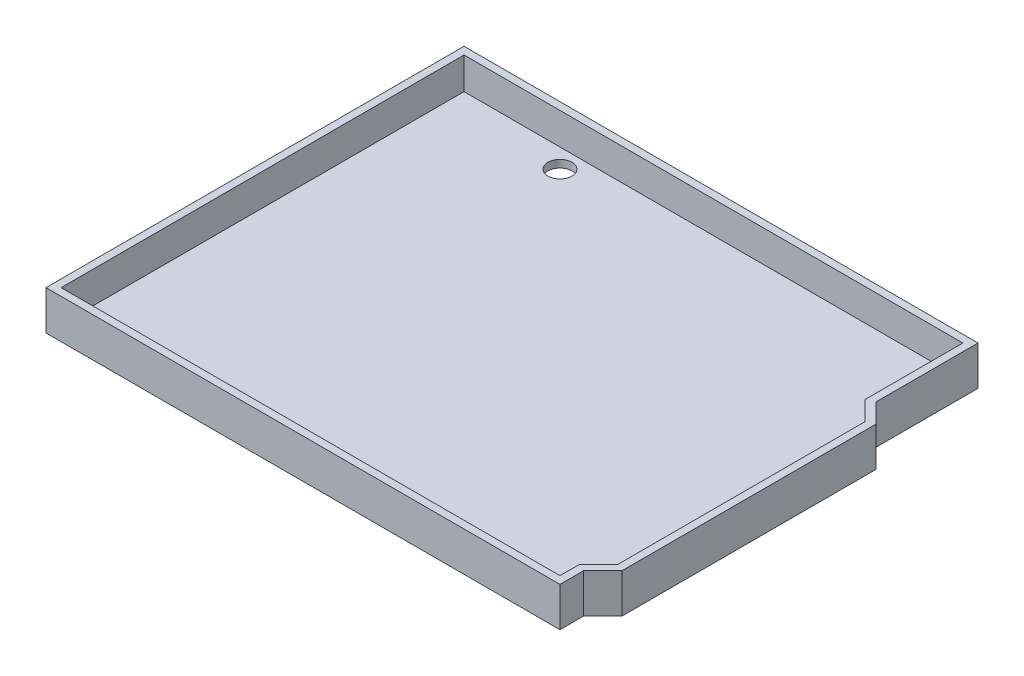
ISO-10303-21;
HEADER;
FILE_DESCRIPTION(('STEP AP214'),'2;1');
FILE_NAME('part.step','',(''),(''),'','','');
FILE_SCHEMA(('AUTOMOTIVE_DESIGN { 1 0 10303 214 1 1 1 1 }'));
ENDSEC;
DATA;
#1=APPLICATION_CONTEXT('core data for automotive mechanical design processes');
#2=APPLICATION_PROTOCOL_DEFINITION('international standard','automotive_design',2000,#1);
#3=PRODUCT_CONTEXT('',#1,'mechanical');
#4=PRODUCT('Part','Part','',(#3));
#5=PRODUCT_RELATED_PRODUCT_CATEGORY('part','',(#4));
#6=PRODUCT_DEFINITION_FORMATION('','',#4);
#7=PRODUCT_DEFINITION_CONTEXT('part definition',#1,'design');
#8=PRODUCT_DEFINITION('design','',#6,#7);
#9=PRODUCT_DEFINITION_SHAPE('','',#8);
#10=(LENGTH_UNIT() NAMED_UNIT(*) SI_UNIT(.MILLI.,.METRE.));
#11=(NAMED_UNIT(*) PLANE_ANGLE_UNIT() SI_UNIT($,.RADIAN.));
#12=(NAMED_UNIT(*) SI_UNIT($,.STERADIAN.) SOLID_ANGLE_UNIT());
#13=UNCERTAINTY_MEASURE_WITH_UNIT(LENGTH_MEASURE(1.E-05),#10,'distance_accuracy_value','');
#14=(GEOMETRIC_REPRESENTATION_CONTEXT(3) GLOBAL_UNCERTAINTY_ASSIGNED_CONTEXT((#13)) GLOBAL_UNIT_ASSIGNED_CONTEXT((#10,
#11,#12)) REPRESENTATION_CONTEXT('',''));
#15=CARTESIAN_POINT('',(0.,0.,0.));
#16=DIRECTION('',(0.,0.,1.));
#17=DIRECTION('',(1.,0.,0.));
#18=AXIS2_PLACEMENT_3D('',#15,#16,#17);
#19=CARTESIAN_POINT('',(33.02,-5.2,19.05));
#20=DIRECTION('',(0.,1.,0.));
#21=DIRECTION('',(0.,0.,1.));
#22=AXIS2_PLACEMENT_3D('',#19,#20,#21);
#23=CYLINDRICAL_SURFACE('',#22,1.59);
#24=CARTESIAN_POINT('',(33.02,-5.2,19.05));
#25=DIRECTION('',(0.,1.,0.));
#26=DIRECTION('',(0.,0.,1.));
#27=AXIS2_PLACEMENT_3D('',#24,#25,#26);
#28=CIRCLE('',#27,1.59);
#29=CARTESIAN_POINT('',(33.02,-5.2,20.64));
#30=VERTEX_POINT('',#29);
#31=EDGE_CURVE('E211',#30,#30,#28,.T.);
#32=ORIENTED_EDGE('',*,*,#31,.F.);
#33=EDGE_LOOP('',(#32));
#34=FACE_BOUND('',#33,.T.);
#35=CARTESIAN_POINT('',(33.02,-4.2,19.05));
#36=DIRECTION('',(0.,1.,0.));
#37=DIRECTION('',(0.,0.,1.));
#38=AXIS2_PLACEMENT_3D('',#35,#36,#37);
#39=CIRCLE('',#38,1.59);
#40=CARTESIAN_POINT('',(33.02,-4.2,20.64));
#41=VERTEX_POINT('',#40);
#42=EDGE_CURVE('E290',#41,#41,#39,.T.);
#43=ORIENTED_EDGE('',*,*,#42,.T.);
#44=EDGE_LOOP('',(#43));
#45=FACE_BOUND('',#44,.T.);
#46=ADVANCED_FACE('F45',(#34,#45),#23,.F.);
#47=CARTESIAN_POINT('',(33.02,-5.2,-8.89));
#48=DIRECTION('',(0.,1.,0.));
#49=DIRECTION('',(0.,0.,1.));
#50=AXIS2_PLACEMENT_3D('',#47,#48,#49);
#51=CYLINDRICAL_SURFACE('',#50,1.59);
#52=CARTESIAN_POINT('',(33.02,-5.2,-8.89));
#53=DIRECTION('',(0.,1.,0.));
#54=DIRECTION('',(0.,0.,1.));
#55=AXIS2_PLACEMENT_3D('',#52,#53,#54);
#56=CIRCLE('',#55,1.59);
#57=CARTESIAN_POINT('',(33.02,-5.2,-7.3));
#58=VERTEX_POINT('',#57);
#59=EDGE_CURVE('E214',#58,#58,#56,.T.);
#60=ORIENTED_EDGE('',*,*,#59,.F.);
#61=EDGE_LOOP('',(#60));
#62=FACE_BOUND('',#61,.T.);
#63=CARTESIAN_POINT('',(33.02,-4.2,-8.89));
#64=DIRECTION('',(0.,1.,0.));
#65=DIRECTION('',(0.,0.,1.));
#66=AXIS2_PLACEMENT_3D('',#63,#64,#65);
#67=CIRCLE('',#66,1.59);
#68=CARTESIAN_POINT('',(33.02,-4.2,-7.3));
#69=VERTEX_POINT('',#68);
#70=EDGE_CURVE('E293',#69,#69,#67,.T.);
#71=ORIENTED_EDGE('',*,*,#70,.T.);
#72=EDGE_LOOP('',(#71));
#73=FACE_BOUND('',#72,.T.);
#74=ADVANCED_FACE('F380',(#62,#73),#51,.F.);
#75=CARTESIAN_POINT('',(-17.78,-5.2,-24.13));
#76=DIRECTION('',(0.,1.,0.));
#77=DIRECTION('',(0.,0.,1.));
#78=AXIS2_PLACEMENT_3D('',#75,#76,#77);
#79=CYLINDRICAL_SURFACE('',#78,1.59);
#80=CARTESIAN_POINT('',(-17.78,-5.2,-24.13));
#81=DIRECTION('',(0.,1.,0.));
#82=DIRECTION('',(0.,0.,1.));
#83=AXIS2_PLACEMENT_3D('',#80,#81,#82);
#84=CIRCLE('',#83,1.59);
#85=CARTESIAN_POINT('',(-17.78,-5.2,-22.54));
#86=VERTEX_POINT('',#85);
#87=EDGE_CURVE('E217',#86,#86,#84,.T.);
#88=ORIENTED_EDGE('',*,*,#87,.F.);
#89=EDGE_LOOP('',(#88));
#90=FACE_BOUND('',#89,.T.);
#91=CARTESIAN_POINT('',(-17.78,-4.2,-24.13));
#92=DIRECTION('',(0.,1.,0.));
#93=DIRECTION('',(0.,0.,1.));
#94=AXIS2_PLACEMENT_3D('',#91,#92,#93);
#95=CIRCLE('',#94,1.59);
#96=CARTESIAN_POINT('',(-17.78,-4.2,-22.54));
#97=VERTEX_POINT('',#96);
#98=EDGE_CURVE('E296',#97,#97,#95,.T.);
#99=ORIENTED_EDGE('',*,*,#98,.T.);
#100=EDGE_LOOP('',(#99));
#101=FACE_BOUND('',#100,.T.);
#102=ADVANCED_FACE('F386',(#90,#101),#79,.F.);
#103=CARTESIAN_POINT('',(-19.05,-5.2,24.13));
#104=DIRECTION('',(0.,1.,0.));
#105=DIRECTION('',(0.,0.,1.));
#106=AXIS2_PLACEMENT_3D('',#103,#104,#105);
#107=CYLINDRICAL_SURFACE('',#106,1.59);
#108=CARTESIAN_POINT('',(-19.05,-5.2,24.13));
#109=DIRECTION('',(0.,1.,0.));
#110=DIRECTION('',(0.,0.,1.));
#111=AXIS2_PLACEMENT_3D('',#108,#109,#110);
#112=CIRCLE('',#111,1.59);
#113=CARTESIAN_POINT('',(-19.05,-5.2,25.72));
#114=VERTEX_POINT('',#113);
#115=EDGE_CURVE('E173',#114,#114,#112,.T.);
#116=ORIENTED_EDGE('',*,*,#115,.F.);
#117=EDGE_LOOP('',(#116));
#118=FACE_BOUND('',#117,.T.);
#119=CARTESIAN_POINT('',(-19.05,-4.2,24.13));
#120=DIRECTION('',(0.,1.,0.));
#121=DIRECTION('',(0.,0.,1.));
#122=AXIS2_PLACEMENT_3D('',#119,#120,#121);
#123=CIRCLE('',#122,1.59);
#124=CARTESIAN_POINT('',(-19.05,-4.2,25.72));
#125=VERTEX_POINT('',#124);
#126=EDGE_CURVE('E247',#125,#125,#123,.T.);
#127=ORIENTED_EDGE('',*,*,#126,.T.);
#128=EDGE_LOOP('',(#127));
#129=FACE_BOUND('',#128,.T.);
#130=ADVANCED_FACE('F47',(#118,#129),#107,.F.);
#131=CARTESIAN_POINT('',(0.,0.,0.));
#132=DIRECTION('',(0.,1.,0.));
#133=DIRECTION('',(0.,0.,1.));
#134=AXIS2_PLACEMENT_3D('',#131,#132,#133);
#135=PLANE('',#134);
#136=DIRECTION('',(0.,0.,1.));
#137=VECTOR('',#136,1.);
#138=CARTESIAN_POINT('',(34.02,0.,0.));
#139=LINE('',#138,#137);
#140=CARTESIAN_POINT('',(34.02,0.,-27.67));
#141=VERTEX_POINT('',#140);
#142=CARTESIAN_POINT('',(34.02,0.,-14.1342135623731));
#143=VERTEX_POINT('',#142);
#144=EDGE_CURVE('E155',#141,#143,#139,.T.);
#145=ORIENTED_EDGE('',*,*,#144,.F.);
#146=DIRECTION('',(1.,0.,0.));
#147=VECTOR('',#146,1.);
#148=CARTESIAN_POINT('',(0.,0.,-27.67));
#149=LINE('',#148,#147);
#150=CARTESIAN_POINT('',(-34.02,0.,-27.67));
#151=VERTEX_POINT('',#150);
#152=EDGE_CURVE('E158',#151,#141,#149,.T.);
#153=ORIENTED_EDGE('',*,*,#152,.F.);
#154=DIRECTION('',(0.,0.,1.));
#155=VECTOR('',#154,1.);
#156=CARTESIAN_POINT('',(-34.02,0.,0.));
#157=LINE('',#156,#155);
#158=CARTESIAN_POINT('',(-34.02,0.,27.67));
#159=VERTEX_POINT('',#158);
#160=EDGE_CURVE('E161',#151,#159,#157,.T.);
#161=ORIENTED_EDGE('',*,*,#160,.T.);
#162=DIRECTION('',(1.,0.,0.));
#163=VECTOR('',#162,1.);
#164=CARTESIAN_POINT('',(0.,0.,27.67));
#165=LINE('',#164,#163);
#166=CARTESIAN_POINT('',(34.02,0.,27.67));
#167=VERTEX_POINT('',#166);
#168=EDGE_CURVE('E164',#159,#167,#165,.T.);
#169=ORIENTED_EDGE('',*,*,#168,.T.);
#170=DIRECTION('',(0.,0.,-1.));
#171=VECTOR('',#170,1.);
#172=CARTESIAN_POINT('',(34.02,0.,0.));
#173=LINE('',#172,#171);
#174=CARTESIAN_POINT('',(34.02,0.,24.5442135623731));
#175=VERTEX_POINT('',#174);
#176=EDGE_CURVE('E167',#167,#175,#173,.T.);
#177=ORIENTED_EDGE('',*,*,#176,.T.);
#178=DIRECTION('',(0.707106781186544,0.,-0.707106781186551));
#179=VECTOR('',#178,1.);
#180=CARTESIAN_POINT('',(29.2821067811867,0.,29.2821067811864));
#181=LINE('',#180,#179);
#182=CARTESIAN_POINT('',(36.56,0.,22.0042135623731));
#183=VERTEX_POINT('',#182);
#184=EDGE_CURVE('E170',#175,#183,#181,.T.);
#185=ORIENTED_EDGE('',*,*,#184,.T.);
#186=DIRECTION('',(0.,0.,-1.));
#187=VECTOR('',#186,1.);
#188=CARTESIAN_POINT('',(36.56,0.,0.));
#189=LINE('',#188,#187);
#190=CARTESIAN_POINT('',(36.56,0.,-11.5942135623731));
#191=VERTEX_POINT('',#190);
#192=EDGE_CURVE('E135',#183,#191,#189,.T.);
#193=ORIENTED_EDGE('',*,*,#192,.T.);
#194=DIRECTION('',(0.707106781186551,0.,0.707106781186544));
#195=VECTOR('',#194,1.);
#196=CARTESIAN_POINT('',(24.0771067811864,0.,-24.0771067811866));
#197=LINE('',#196,#195);
#198=EDGE_CURVE('E104',#143,#191,#197,.T.);
#199=ORIENTED_EDGE('',*,*,#198,.F.);
#200=EDGE_LOOP('',(#145,#153,#161,#169,#177,#185,#193,#199));
#201=FACE_BOUND('',#200,.T.);
#202=DIRECTION('',(0.,0.,1.));
#203=VECTOR('',#202,1.);
#204=CARTESIAN_POINT('',(33.02,0.,0.));
#205=LINE('',#204,#203);
#206=CARTESIAN_POINT('',(33.02,0.,-26.67));
#207=VERTEX_POINT('',#206);
#208=CARTESIAN_POINT('',(33.02,0.,-13.72));
#209=VERTEX_POINT('',#208);
#210=EDGE_CURVE('E263',#207,#209,#205,.T.);
#211=ORIENTED_EDGE('',*,*,#210,.T.);
#212=DIRECTION('',(0.70710678118655,0.,0.707106781186545));
#213=VECTOR('',#212,1.);
#214=CARTESIAN_POINT('',(23.3699999999999,0.,-23.37));
#215=LINE('',#214,#213);
#216=CARTESIAN_POINT('',(35.56,0.,-11.18));
#217=VERTEX_POINT('',#216);
#218=EDGE_CURVE('E62',#209,#217,#215,.T.);
#219=ORIENTED_EDGE('',*,*,#218,.T.);
#220=DIRECTION('',(0.,0.,-1.));
#221=VECTOR('',#220,1.);
#222=CARTESIAN_POINT('',(35.56,0.,0.));
#223=LINE('',#222,#221);
#224=CARTESIAN_POINT('',(35.56,0.,21.59));
#225=VERTEX_POINT('',#224);
#226=EDGE_CURVE('E244',#225,#217,#223,.T.);
#227=ORIENTED_EDGE('',*,*,#226,.F.);
#228=DIRECTION('',(0.707106781186545,0.,-0.70710678118655));
#229=VECTOR('',#228,1.);
#230=CARTESIAN_POINT('',(28.5750000000001,0.,28.5749999999999));
#231=LINE('',#230,#229);
#232=CARTESIAN_POINT('',(33.02,0.,24.13));
#233=VERTEX_POINT('',#232);
#234=EDGE_CURVE('E248',#233,#225,#231,.T.);
#235=ORIENTED_EDGE('',*,*,#234,.F.);
#236=DIRECTION('',(0.,0.,-1.));
#237=VECTOR('',#236,1.);
#238=CARTESIAN_POINT('',(33.02,0.,0.));
#239=LINE('',#238,#237);
#240=CARTESIAN_POINT('',(33.02,0.,26.67));
#241=VERTEX_POINT('',#240);
#242=EDGE_CURVE('E251',#241,#233,#239,.T.);
#243=ORIENTED_EDGE('',*,*,#242,.F.);
#244=DIRECTION('',(1.,0.,0.));
#245=VECTOR('',#244,1.);
#246=CARTESIAN_POINT('',(0.,0.,26.67));
#247=LINE('',#246,#245);
#248=CARTESIAN_POINT('',(-33.02,0.,26.67));
#249=VERTEX_POINT('',#248);
#250=EDGE_CURVE('E254',#249,#241,#247,.T.);
#251=ORIENTED_EDGE('',*,*,#250,.F.);
#252=DIRECTION('',(0.,0.,1.));
#253=VECTOR('',#252,1.);
#254=CARTESIAN_POINT('',(-33.02,0.,0.));
#255=LINE('',#254,#253);
#256=CARTESIAN_POINT('',(-33.02,0.,-26.67));
#257=VERTEX_POINT('',#256);
#258=EDGE_CURVE('E257',#257,#249,#255,.T.);
#259=ORIENTED_EDGE('',*,*,#258,.F.);
#260=DIRECTION('',(1.,0.,0.));
#261=VECTOR('',#260,1.);
#262=CARTESIAN_POINT('',(0.,0.,-26.67));
#263=LINE('',#262,#261);
#264=EDGE_CURVE('E260',#257,#207,#263,.T.);
#265=ORIENTED_EDGE('',*,*,#264,.T.);
#266=EDGE_LOOP('',(#211,#219,#227,#235,#243,#251,#259,#265));
#267=FACE_BOUND('',#266,.T.);
#268=ADVANCED_FACE('F189',(#201,#267),#135,.T.);
#269=CARTESIAN_POINT('',(34.02,-5.2,0.));
#270=DIRECTION('',(-1.,0.,0.));
#271=DIRECTION('',(0.,0.,1.));
#272=AXIS2_PLACEMENT_3D('',#269,#270,#271);
#273=PLANE('',#272);
#274=ORIENTED_EDGE('',*,*,#144,.T.);
#275=DIRECTION('',(0.,1.,0.));
#276=VECTOR('',#275,1.);
#277=CARTESIAN_POINT('',(34.02,-5.2,-14.1342135623731));
#278=LINE('',#277,#276);
#279=CARTESIAN_POINT('',(34.02,-5.2,-14.1342135623731));
#280=VERTEX_POINT('',#279);
#281=EDGE_CURVE('E12',#280,#143,#278,.T.);
#282=ORIENTED_EDGE('',*,*,#281,.F.);
#283=DIRECTION('',(0.,0.,1.));
#284=VECTOR('',#283,1.);
#285=CARTESIAN_POINT('',(34.02,-5.2,0.));
#286=LINE('',#285,#284);
#287=CARTESIAN_POINT('',(34.02,-5.2,-27.67));
#288=VERTEX_POINT('',#287);
#289=EDGE_CURVE('E188',#288,#280,#286,.T.);
#290=ORIENTED_EDGE('',*,*,#289,.F.);
#291=DIRECTION('',(0.,1.,0.));
#292=VECTOR('',#291,1.);
#293=CARTESIAN_POINT('',(34.02,-5.2,-27.67));
#294=LINE('',#293,#292);
#295=EDGE_CURVE('E49',#288,#141,#294,.T.);
#296=ORIENTED_EDGE('',*,*,#295,.T.);
#297=EDGE_LOOP('',(#274,#282,#290,#296));
#298=FACE_BOUND('',#297,.T.);
#299=ADVANCED_FACE('F186',(#298),#273,.F.);
#300=CARTESIAN_POINT('',(24.0771067811864,-5.2,-24.0771067811866));
#301=DIRECTION('',(-0.707106781186544,0.,0.707106781186551));
#302=DIRECTION('',(0.707106781186551,0.,0.707106781186544));
#303=AXIS2_PLACEMENT_3D('',#300,#301,#302);
#304=PLANE('',#303);
#305=ORIENTED_EDGE('',*,*,#198,.T.);
#306=DIRECTION('',(0.,1.,0.));
#307=VECTOR('',#306,1.);
#308=CARTESIAN_POINT('',(36.56,-5.2,-11.5942135623731));
#309=LINE('',#308,#307);
#310=CARTESIAN_POINT('',(36.56,-5.2,-11.5942135623731));
#311=VERTEX_POINT('',#310);
#312=EDGE_CURVE('E54',#311,#191,#309,.T.);
#313=ORIENTED_EDGE('',*,*,#312,.F.);
#314=DIRECTION('',(0.707106781186551,0.,0.707106781186544));
#315=VECTOR('',#314,1.);
#316=CARTESIAN_POINT('',(24.0771067811864,-5.2,-24.0771067811866));
#317=LINE('',#316,#315);
#318=EDGE_CURVE('E70',#280,#311,#317,.T.);
#319=ORIENTED_EDGE('',*,*,#318,.F.);
#320=ORIENTED_EDGE('',*,*,#281,.T.);
#321=EDGE_LOOP('',(#305,#313,#319,#320));
#322=FACE_BOUND('',#321,.T.);
#323=ADVANCED_FACE('F418',(#322),#304,.F.);
#324=CARTESIAN_POINT('',(36.56,-5.2,0.));
#325=DIRECTION('',(1.,0.,0.));
#326=DIRECTION('',(0.,0.,-1.));
#327=AXIS2_PLACEMENT_3D('',#324,#325,#326);
#328=PLANE('',#327);
#329=ORIENTED_EDGE('',*,*,#192,.F.);
#330=DIRECTION('',(0.,1.,0.));
#331=VECTOR('',#330,1.);
#332=CARTESIAN_POINT('',(36.56,-5.2,22.0042135623731));
#333=LINE('',#332,#331);
#334=CARTESIAN_POINT('',(36.56,-5.2,22.0042135623731));
#335=VERTEX_POINT('',#334);
#336=EDGE_CURVE('E131',#335,#183,#333,.T.);
#337=ORIENTED_EDGE('',*,*,#336,.F.);
#338=DIRECTION('',(0.,0.,-1.));
#339=VECTOR('',#338,1.);
#340=CARTESIAN_POINT('',(36.56,-5.2,0.));
#341=LINE('',#340,#339);
#342=EDGE_CURVE('E134',#335,#311,#341,.T.);
#343=ORIENTED_EDGE('',*,*,#342,.T.);
#344=ORIENTED_EDGE('',*,*,#312,.T.);
#345=EDGE_LOOP('',(#329,#337,#343,#344));
#346=FACE_BOUND('',#345,.T.);
#347=ADVANCED_FACE('F133',(#346),#328,.T.);
#348=CARTESIAN_POINT('',(29.2821067811867,-5.2,29.2821067811864));
#349=DIRECTION('',(0.707106781186551,0.,0.707106781186544));
#350=DIRECTION('',(0.707106781186544,0.,-0.707106781186551));
#351=AXIS2_PLACEMENT_3D('',#348,#349,#350);
#352=PLANE('',#351);
#353=ORIENTED_EDGE('',*,*,#184,.F.);
#354=DIRECTION('',(0.,1.,0.));
#355=VECTOR('',#354,1.);
#356=CARTESIAN_POINT('',(34.02,-5.2,24.5442135623731));
#357=LINE('',#356,#355);
#358=CARTESIAN_POINT('',(34.02,-5.2,24.5442135623731));
#359=VERTEX_POINT('',#358);
#360=EDGE_CURVE('E140',#359,#175,#357,.T.);
#361=ORIENTED_EDGE('',*,*,#360,.F.);
#362=DIRECTION('',(0.707106781186544,0.,-0.707106781186551));
#363=VECTOR('',#362,1.);
#364=CARTESIAN_POINT('',(29.2821067811867,-5.2,29.2821067811864));
#365=LINE('',#364,#363);
#366=EDGE_CURVE('E145',#359,#335,#365,.T.);
#367=ORIENTED_EDGE('',*,*,#366,.T.);
#368=ORIENTED_EDGE('',*,*,#336,.T.);
#369=EDGE_LOOP('',(#353,#361,#367,#368));
#370=FACE_BOUND('',#369,.T.);
#371=ADVANCED_FACE('F148',(#370),#352,.T.);
#372=CARTESIAN_POINT('',(34.02,-5.2,0.));
#373=DIRECTION('',(1.,0.,0.));
#374=DIRECTION('',(0.,0.,-1.));
#375=AXIS2_PLACEMENT_3D('',#372,#373,#374);
#376=PLANE('',#375);
#377=ORIENTED_EDGE('',*,*,#176,.F.);
#378=DIRECTION('',(0.,1.,0.));
#379=VECTOR('',#378,1.);
#380=CARTESIAN_POINT('',(34.02,-5.2,27.67));
#381=LINE('',#380,#379);
#382=CARTESIAN_POINT('',(34.02,-5.2,27.67));
#383=VERTEX_POINT('',#382);
#384=EDGE_CURVE('E177',#383,#167,#381,.T.);
#385=ORIENTED_EDGE('',*,*,#384,.F.);
#386=DIRECTION('',(0.,0.,-1.));
#387=VECTOR('',#386,1.);
#388=CARTESIAN_POINT('',(34.02,-5.2,0.));
#389=LINE('',#388,#387);
#390=EDGE_CURVE('E149',#383,#359,#389,.T.);
#391=ORIENTED_EDGE('',*,*,#390,.T.);
#392=ORIENTED_EDGE('',*,*,#360,.T.);
#393=EDGE_LOOP('',(#377,#385,#391,#392));
#394=FACE_BOUND('',#393,.T.);
#395=ADVANCED_FACE('F203',(#394),#376,.T.);
#396=CARTESIAN_POINT('',(0.,-5.2,27.67));
#397=DIRECTION('',(0.,0.,1.));
#398=DIRECTION('',(1.,0.,0.));
#399=AXIS2_PLACEMENT_3D('',#396,#397,#398);
#400=PLANE('',#399);
#401=ORIENTED_EDGE('',*,*,#168,.F.);
#402=DIRECTION('',(0.,1.,0.));
#403=VECTOR('',#402,1.);
#404=CARTESIAN_POINT('',(-34.02,-5.2,27.67));
#405=LINE('',#404,#403);
#406=CARTESIAN_POINT('',(-34.02,-5.2,27.67));
#407=VERTEX_POINT('',#406);
#408=EDGE_CURVE('E179',#407,#159,#405,.T.);
#409=ORIENTED_EDGE('',*,*,#408,.F.);
#410=DIRECTION('',(1.,0.,0.));
#411=VECTOR('',#410,1.);
#412=CARTESIAN_POINT('',(0.,-5.2,27.67));
#413=LINE('',#412,#411);
#414=EDGE_CURVE('E151',#407,#383,#413,.T.);
#415=ORIENTED_EDGE('',*,*,#414,.T.);
#416=ORIENTED_EDGE('',*,*,#384,.T.);
#417=EDGE_LOOP('',(#401,#409,#415,#416));
#418=FACE_BOUND('',#417,.T.);
#419=ADVANCED_FACE('F200',(#418),#400,.T.);
#420=CARTESIAN_POINT('',(-34.02,-5.2,0.));
#421=DIRECTION('',(-1.,0.,0.));
#422=DIRECTION('',(0.,0.,1.));
#423=AXIS2_PLACEMENT_3D('',#420,#421,#422);
#424=PLANE('',#423);
#425=ORIENTED_EDGE('',*,*,#160,.F.);
#426=DIRECTION('',(0.,1.,0.));
#427=VECTOR('',#426,1.);
#428=CARTESIAN_POINT('',(-34.02,-5.2,-27.67));
#429=LINE('',#428,#427);
#430=CARTESIAN_POINT('',(-34.02,-5.2,-27.67));
#431=VERTEX_POINT('',#430);
#432=EDGE_CURVE('E180',#431,#151,#429,.T.);
#433=ORIENTED_EDGE('',*,*,#432,.F.);
#434=DIRECTION('',(0.,0.,1.));
#435=VECTOR('',#434,1.);
#436=CARTESIAN_POINT('',(-34.02,-5.2,0.));
#437=LINE('',#436,#435);
#438=EDGE_CURVE('E196',#431,#407,#437,.T.);
#439=ORIENTED_EDGE('',*,*,#438,.T.);
#440=ORIENTED_EDGE('',*,*,#408,.T.);
#441=EDGE_LOOP('',(#425,#433,#439,#440));
#442=FACE_BOUND('',#441,.T.);
#443=ADVANCED_FACE('F193',(#442),#424,.T.);
#444=CARTESIAN_POINT('',(0.,-5.2,-27.67));
#445=DIRECTION('',(0.,0.,1.));
#446=DIRECTION('',(1.,0.,0.));
#447=AXIS2_PLACEMENT_3D('',#444,#445,#446);
#448=PLANE('',#447);
#449=ORIENTED_EDGE('',*,*,#152,.T.);
#450=ORIENTED_EDGE('',*,*,#295,.F.);
#451=DIRECTION('',(1.,0.,0.));
#452=VECTOR('',#451,1.);
#453=CARTESIAN_POINT('',(0.,-5.2,-27.67));
#454=LINE('',#453,#452);
#455=EDGE_CURVE('E111',#431,#288,#454,.T.);
#456=ORIENTED_EDGE('',*,*,#455,.F.);
#457=ORIENTED_EDGE('',*,*,#432,.T.);
#458=EDGE_LOOP('',(#449,#450,#456,#457));
#459=FACE_BOUND('',#458,.T.);
#460=ADVANCED_FACE('F404',(#459),#448,.F.);
#461=CARTESIAN_POINT('',(0.,-5.2,0.));
#462=DIRECTION('',(0.,1.,0.));
#463=DIRECTION('',(0.,0.,1.));
#464=AXIS2_PLACEMENT_3D('',#461,#462,#463);
#465=PLANE('',#464);
#466=ORIENTED_EDGE('',*,*,#115,.T.);
#467=EDGE_LOOP('',(#466));
#468=FACE_BOUND('',#467,.T.);
#469=ORIENTED_EDGE('',*,*,#87,.T.);
#470=EDGE_LOOP('',(#469));
#471=FACE_BOUND('',#470,.T.);
#472=ORIENTED_EDGE('',*,*,#59,.T.);
#473=EDGE_LOOP('',(#472));
#474=FACE_BOUND('',#473,.T.);
#475=ORIENTED_EDGE('',*,*,#31,.T.);
#476=EDGE_LOOP('',(#475));
#477=FACE_BOUND('',#476,.T.);
#478=ORIENTED_EDGE('',*,*,#289,.T.);
#479=ORIENTED_EDGE('',*,*,#318,.T.);
#480=ORIENTED_EDGE('',*,*,#342,.F.);
#481=ORIENTED_EDGE('',*,*,#366,.F.);
#482=ORIENTED_EDGE('',*,*,#390,.F.);
#483=ORIENTED_EDGE('',*,*,#414,.F.);
#484=ORIENTED_EDGE('',*,*,#438,.F.);
#485=ORIENTED_EDGE('',*,*,#455,.T.);
#486=EDGE_LOOP('',(#478,#479,#480,#481,#482,#483,#484,#485));
#487=FACE_BOUND('',#486,.T.);
#488=ADVANCED_FACE('F143',(#468,#471,#474,#477,#487),#465,.F.);
#489=CARTESIAN_POINT('',(23.3699999999999,-4.2,-23.37));
#490=DIRECTION('',(-0.707106781186545,0.,0.70710678118655));
#491=DIRECTION('',(0.70710678118655,0.,0.707106781186545));
#492=AXIS2_PLACEMENT_3D('',#489,#490,#491);
#493=PLANE('',#492);
#494=ORIENTED_EDGE('',*,*,#218,.F.);
#495=DIRECTION('',(0.,1.,0.));
#496=VECTOR('',#495,1.);
#497=CARTESIAN_POINT('',(33.02,-4.2,-13.72));
#498=LINE('',#497,#496);
#499=CARTESIAN_POINT('',(33.02,-4.2,-13.72));
#500=VERTEX_POINT('',#499);
#501=EDGE_CURVE('E222',#500,#209,#498,.T.);
#502=ORIENTED_EDGE('',*,*,#501,.F.);
#503=DIRECTION('',(0.70710678118655,0.,0.707106781186545));
#504=VECTOR('',#503,1.);
#505=CARTESIAN_POINT('',(23.3699999999999,-4.2,-23.37));
#506=LINE('',#505,#504);
#507=CARTESIAN_POINT('',(35.56,-4.2,-11.18));
#508=VERTEX_POINT('',#507);
#509=EDGE_CURVE('E287',#500,#508,#506,.T.);
#510=ORIENTED_EDGE('',*,*,#509,.T.);
#511=DIRECTION('',(0.,1.,0.));
#512=VECTOR('',#511,1.);
#513=CARTESIAN_POINT('',(35.56,-4.2,-11.18));
#514=LINE('',#513,#512);
#515=EDGE_CURVE('E159',#508,#217,#514,.T.);
#516=ORIENTED_EDGE('',*,*,#515,.T.);
#517=EDGE_LOOP('',(#494,#502,#510,#516));
#518=FACE_BOUND('',#517,.T.);
#519=ADVANCED_FACE('F322',(#518),#493,.T.);
#520=CARTESIAN_POINT('',(35.56,-4.2,0.));
#521=DIRECTION('',(1.,0.,0.));
#522=DIRECTION('',(0.,0.,-1.));
#523=AXIS2_PLACEMENT_3D('',#520,#521,#522);
#524=PLANE('',#523);
#525=ORIENTED_EDGE('',*,*,#226,.T.);
#526=ORIENTED_EDGE('',*,*,#515,.F.);
#527=DIRECTION('',(0.,0.,-1.));
#528=VECTOR('',#527,1.);
#529=CARTESIAN_POINT('',(35.56,-4.2,0.));
#530=LINE('',#529,#528);
#531=CARTESIAN_POINT('',(35.56,-4.2,21.59));
#532=VERTEX_POINT('',#531);
#533=EDGE_CURVE('E225',#532,#508,#530,.T.);
#534=ORIENTED_EDGE('',*,*,#533,.F.);
#535=DIRECTION('',(0.,1.,0.));
#536=VECTOR('',#535,1.);
#537=CARTESIAN_POINT('',(35.56,-4.2,21.59));
#538=LINE('',#537,#536);
#539=EDGE_CURVE('E240',#532,#225,#538,.T.);
#540=ORIENTED_EDGE('',*,*,#539,.T.);
#541=EDGE_LOOP('',(#525,#526,#534,#540));
#542=FACE_BOUND('',#541,.T.);
#543=ADVANCED_FACE('F326',(#542),#524,.F.);
#544=CARTESIAN_POINT('',(28.5750000000001,-4.2,28.5749999999999));
#545=DIRECTION('',(0.70710678118655,0.,0.707106781186545));
#546=DIRECTION('',(0.707106781186545,0.,-0.70710678118655));
#547=AXIS2_PLACEMENT_3D('',#544,#545,#546);
#548=PLANE('',#547);
#549=ORIENTED_EDGE('',*,*,#234,.T.);
#550=ORIENTED_EDGE('',*,*,#539,.F.);
#551=DIRECTION('',(0.707106781186545,0.,-0.70710678118655));
#552=VECTOR('',#551,1.);
#553=CARTESIAN_POINT('',(28.5750000000001,-4.2,28.5749999999999));
#554=LINE('',#553,#552);
#555=CARTESIAN_POINT('',(33.02,-4.2,24.13));
#556=VERTEX_POINT('',#555);
#557=EDGE_CURVE('E269',#556,#532,#554,.T.);
#558=ORIENTED_EDGE('',*,*,#557,.F.);
#559=DIRECTION('',(0.,1.,0.));
#560=VECTOR('',#559,1.);
#561=CARTESIAN_POINT('',(33.02,-4.2,24.13));
#562=LINE('',#561,#560);
#563=EDGE_CURVE('E237',#556,#233,#562,.T.);
#564=ORIENTED_EDGE('',*,*,#563,.T.);
#565=EDGE_LOOP('',(#549,#550,#558,#564));
#566=FACE_BOUND('',#565,.T.);
#567=ADVANCED_FACE('F351',(#566),#548,.F.);
#568=CARTESIAN_POINT('',(33.02,-4.2,0.));
#569=DIRECTION('',(1.,0.,0.));
#570=DIRECTION('',(0.,0.,-1.));
#571=AXIS2_PLACEMENT_3D('',#568,#569,#570);
#572=PLANE('',#571);
#573=ORIENTED_EDGE('',*,*,#242,.T.);
#574=ORIENTED_EDGE('',*,*,#563,.F.);
#575=DIRECTION('',(0.,0.,-1.));
#576=VECTOR('',#575,1.);
#577=CARTESIAN_POINT('',(33.02,-4.2,0.));
#578=LINE('',#577,#576);
#579=CARTESIAN_POINT('',(33.02,-4.2,26.67));
#580=VERTEX_POINT('',#579);
#581=EDGE_CURVE('E272',#580,#556,#578,.T.);
#582=ORIENTED_EDGE('',*,*,#581,.F.);
#583=DIRECTION('',(0.,1.,0.));
#584=VECTOR('',#583,1.);
#585=CARTESIAN_POINT('',(33.02,-4.2,26.67));
#586=LINE('',#585,#584);
#587=EDGE_CURVE('E234',#580,#241,#586,.T.);
#588=ORIENTED_EDGE('',*,*,#587,.T.);
#589=EDGE_LOOP('',(#573,#574,#582,#588));
#590=FACE_BOUND('',#589,.T.);
#591=ADVANCED_FACE('F356',(#590),#572,.F.);
#592=CARTESIAN_POINT('',(0.,-4.2,26.67));
#593=DIRECTION('',(0.,0.,1.));
#594=DIRECTION('',(1.,0.,0.));
#595=AXIS2_PLACEMENT_3D('',#592,#593,#594);
#596=PLANE('',#595);
#597=ORIENTED_EDGE('',*,*,#250,.T.);
#598=ORIENTED_EDGE('',*,*,#587,.F.);
#599=DIRECTION('',(1.,0.,0.));
#600=VECTOR('',#599,1.);
#601=CARTESIAN_POINT('',(0.,-4.2,26.67));
#602=LINE('',#601,#600);
#603=CARTESIAN_POINT('',(-33.02,-4.2,26.67));
#604=VERTEX_POINT('',#603);
#605=EDGE_CURVE('E275',#604,#580,#602,.T.);
#606=ORIENTED_EDGE('',*,*,#605,.F.);
#607=DIRECTION('',(0.,1.,0.));
#608=VECTOR('',#607,1.);
#609=CARTESIAN_POINT('',(-33.02,-4.2,26.67));
#610=LINE('',#609,#608);
#611=EDGE_CURVE('E231',#604,#249,#610,.T.);
#612=ORIENTED_EDGE('',*,*,#611,.T.);
#613=EDGE_LOOP('',(#597,#598,#606,#612));
#614=FACE_BOUND('',#613,.T.);
#615=ADVANCED_FACE('F360',(#614),#596,.F.);
#616=CARTESIAN_POINT('',(-33.02,-4.2,0.));
#617=DIRECTION('',(-1.,0.,0.));
#618=DIRECTION('',(0.,0.,1.));
#619=AXIS2_PLACEMENT_3D('',#616,#617,#618);
#620=PLANE('',#619);
#621=ORIENTED_EDGE('',*,*,#258,.T.);
#622=ORIENTED_EDGE('',*,*,#611,.F.);
#623=DIRECTION('',(0.,0.,1.));
#624=VECTOR('',#623,1.);
#625=CARTESIAN_POINT('',(-33.02,-4.2,0.));
#626=LINE('',#625,#624);
#627=CARTESIAN_POINT('',(-33.02,-4.2,-26.67));
#628=VERTEX_POINT('',#627);
#629=EDGE_CURVE('E278',#628,#604,#626,.T.);
#630=ORIENTED_EDGE('',*,*,#629,.F.);
#631=DIRECTION('',(0.,1.,0.));
#632=VECTOR('',#631,1.);
#633=CARTESIAN_POINT('',(-33.02,-4.2,-26.67));
#634=LINE('',#633,#632);
#635=EDGE_CURVE('E228',#628,#257,#634,.T.);
#636=ORIENTED_EDGE('',*,*,#635,.T.);
#637=EDGE_LOOP('',(#621,#622,#630,#636));
#638=FACE_BOUND('',#637,.T.);
#639=ADVANCED_FACE('F367',(#638),#620,.F.);
#640=CARTESIAN_POINT('',(0.,-4.2,-26.67));
#641=DIRECTION('',(0.,0.,1.));
#642=DIRECTION('',(1.,0.,0.));
#643=AXIS2_PLACEMENT_3D('',#640,#641,#642);
#644=PLANE('',#643);
#645=ORIENTED_EDGE('',*,*,#264,.F.);
#646=ORIENTED_EDGE('',*,*,#635,.F.);
#647=DIRECTION('',(1.,0.,0.));
#648=VECTOR('',#647,1.);
#649=CARTESIAN_POINT('',(0.,-4.2,-26.67));
#650=LINE('',#649,#648);
#651=CARTESIAN_POINT('',(33.02,-4.2,-26.67));
#652=VERTEX_POINT('',#651);
#653=EDGE_CURVE('E281',#628,#652,#650,.T.);
#654=ORIENTED_EDGE('',*,*,#653,.T.);
#655=DIRECTION('',(0.,1.,0.));
#656=VECTOR('',#655,1.);
#657=CARTESIAN_POINT('',(33.02,-4.2,-26.67));
#658=LINE('',#657,#656);
#659=EDGE_CURVE('E224',#652,#207,#658,.T.);
#660=ORIENTED_EDGE('',*,*,#659,.T.);
#661=EDGE_LOOP('',(#645,#646,#654,#660));
#662=FACE_BOUND('',#661,.T.);
#663=ADVANCED_FACE('F370',(#662),#644,.T.);
#664=CARTESIAN_POINT('',(33.02,-4.2,0.));
#665=DIRECTION('',(-1.,0.,0.));
#666=DIRECTION('',(0.,0.,1.));
#667=AXIS2_PLACEMENT_3D('',#664,#665,#666);
#668=PLANE('',#667);
#669=ORIENTED_EDGE('',*,*,#210,.F.);
#670=ORIENTED_EDGE('',*,*,#659,.F.);
#671=DIRECTION('',(0.,0.,1.));
#672=VECTOR('',#671,1.);
#673=CARTESIAN_POINT('',(33.02,-4.2,0.));
#674=LINE('',#673,#672);
#675=EDGE_CURVE('E284',#652,#500,#674,.T.);
#676=ORIENTED_EDGE('',*,*,#675,.T.);
#677=ORIENTED_EDGE('',*,*,#501,.T.);
#678=EDGE_LOOP('',(#669,#670,#676,#677));
#679=FACE_BOUND('',#678,.T.);
#680=ADVANCED_FACE('F306',(#679),#668,.T.);
#681=CARTESIAN_POINT('',(0.,-4.2,0.));
#682=DIRECTION('',(0.,1.,0.));
#683=DIRECTION('',(0.,0.,1.));
#684=AXIS2_PLACEMENT_3D('',#681,#682,#683);
#685=PLANE('',#684);
#686=ORIENTED_EDGE('',*,*,#126,.F.);
#687=EDGE_LOOP('',(#686));
#688=FACE_BOUND('',#687,.T.);
#689=ORIENTED_EDGE('',*,*,#98,.F.);
#690=EDGE_LOOP('',(#689));
#691=FACE_BOUND('',#690,.T.);
#692=ORIENTED_EDGE('',*,*,#70,.F.);
#693=EDGE_LOOP('',(#692));
#694=FACE_BOUND('',#693,.T.);
#695=ORIENTED_EDGE('',*,*,#42,.F.);
#696=EDGE_LOOP('',(#695));
#697=FACE_BOUND('',#696,.T.);
#698=ORIENTED_EDGE('',*,*,#509,.F.);
#699=ORIENTED_EDGE('',*,*,#675,.F.);
#700=ORIENTED_EDGE('',*,*,#653,.F.);
#701=ORIENTED_EDGE('',*,*,#629,.T.);
#702=ORIENTED_EDGE('',*,*,#605,.T.);
#703=ORIENTED_EDGE('',*,*,#581,.T.);
#704=ORIENTED_EDGE('',*,*,#557,.T.);
#705=ORIENTED_EDGE('',*,*,#533,.T.);
#706=EDGE_LOOP('',(#698,#699,#700,#701,#702,#703,#704,#705));
#707=FACE_BOUND('',#706,.T.);
#708=ADVANCED_FACE('F303',(#688,#691,#694,#697,#707),#685,.T.);
#709=CLOSED_SHELL('',(#46,#74,#102,#130,#268,#299,#323,#347,#371,#395,#419,#443,#460,#488,#519,
#543,#567,#591,#615,#639,#663,#680,#708));
#710=MANIFOLD_SOLID_BREP('B2',#709);
#711=ADVANCED_BREP_SHAPE_REPRESENTATION('',(#18,#710),#14);
#712=SHAPE_DEFINITION_REPRESENTATION(#9,#711);
ENDSEC;
END-ISO-10303-21;
